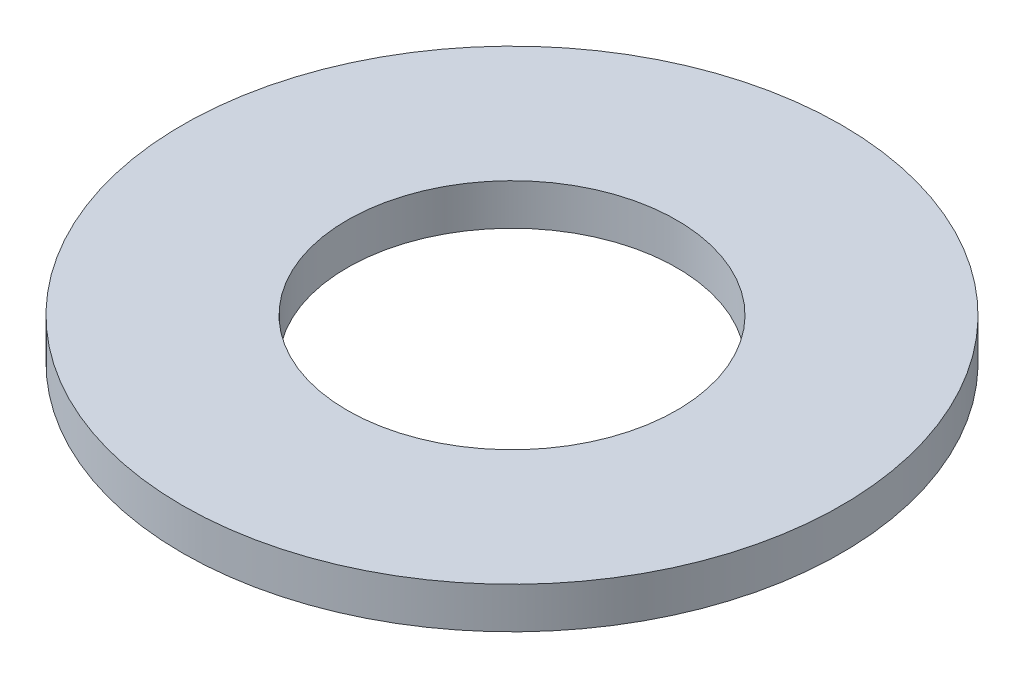
ISO-10303-21;
HEADER;
FILE_DESCRIPTION(('STEP AP214'),'2;1');
FILE_NAME('part.step','',(''),(''),'','','');
FILE_SCHEMA(('AUTOMOTIVE_DESIGN { 1 0 10303 214 1 1 1 1 }'));
ENDSEC;
DATA;
#1=APPLICATION_CONTEXT('core data for automotive mechanical design processes');
#2=APPLICATION_PROTOCOL_DEFINITION('international standard','automotive_design',2000,#1);
#3=PRODUCT_CONTEXT('',#1,'mechanical');
#4=PRODUCT('Part','Part','',(#3));
#5=PRODUCT_RELATED_PRODUCT_CATEGORY('part','',(#4));
#6=PRODUCT_DEFINITION_FORMATION('','',#4);
#7=PRODUCT_DEFINITION_CONTEXT('part definition',#1,'design');
#8=PRODUCT_DEFINITION('design','',#6,#7);
#9=PRODUCT_DEFINITION_SHAPE('','',#8);
#10=(LENGTH_UNIT() NAMED_UNIT(*) SI_UNIT(.MILLI.,.METRE.));
#11=(NAMED_UNIT(*) PLANE_ANGLE_UNIT() SI_UNIT($,.RADIAN.));
#12=(NAMED_UNIT(*) SI_UNIT($,.STERADIAN.) SOLID_ANGLE_UNIT());
#13=UNCERTAINTY_MEASURE_WITH_UNIT(LENGTH_MEASURE(1.E-05),#10,'distance_accuracy_value','');
#14=(GEOMETRIC_REPRESENTATION_CONTEXT(3) GLOBAL_UNCERTAINTY_ASSIGNED_CONTEXT((#13)) GLOBAL_UNIT_ASSIGNED_CONTEXT((#10,
#11,#12)) REPRESENTATION_CONTEXT('',''));
#15=CARTESIAN_POINT('',(0.,0.,0.));
#16=DIRECTION('',(0.,0.,1.));
#17=DIRECTION('',(1.,0.,0.));
#18=AXIS2_PLACEMENT_3D('',#15,#16,#17);
#19=CARTESIAN_POINT('',(0.,1.,0.));
#20=DIRECTION('',(0.,1.,0.));
#21=DIRECTION('',(0.,0.,1.));
#22=AXIS2_PLACEMENT_3D('',#19,#20,#21);
#23=PLANE('',#22);
#24=CARTESIAN_POINT('',(0.,1.,0.));
#25=DIRECTION('',(0.,1.,0.));
#26=DIRECTION('',(0.,0.,1.));
#27=AXIS2_PLACEMENT_3D('',#24,#25,#26);
#28=CIRCLE('',#27,8.);
#29=CARTESIAN_POINT('',(0.,1.,8.));
#30=VERTEX_POINT('',#29);
#31=EDGE_CURVE('E10',#30,#30,#28,.T.);
#32=ORIENTED_EDGE('',*,*,#31,.T.);
#33=EDGE_LOOP('',(#32));
#34=FACE_BOUND('',#33,.T.);
#35=CARTESIAN_POINT('',(0.,1.,0.));
#36=DIRECTION('',(0.,1.,0.));
#37=DIRECTION('',(0.,0.,1.));
#38=AXIS2_PLACEMENT_3D('',#35,#36,#37);
#39=CIRCLE('',#38,4.);
#40=CARTESIAN_POINT('',(0.,1.,4.));
#41=VERTEX_POINT('',#40);
#42=EDGE_CURVE('E40',#41,#41,#39,.T.);
#43=ORIENTED_EDGE('',*,*,#42,.F.);
#44=EDGE_LOOP('',(#43));
#45=FACE_BOUND('',#44,.T.);
#46=ADVANCED_FACE('F29',(#34,#45),#23,.T.);
#47=CARTESIAN_POINT('',(0.,0.,0.));
#48=DIRECTION('',(0.,1.,0.));
#49=DIRECTION('',(0.,0.,1.));
#50=AXIS2_PLACEMENT_3D('',#47,#48,#49);
#51=PLANE('',#50);
#52=CARTESIAN_POINT('',(0.,0.,0.));
#53=DIRECTION('',(0.,1.,0.));
#54=DIRECTION('',(0.,0.,1.));
#55=AXIS2_PLACEMENT_3D('',#52,#53,#54);
#56=CIRCLE('',#55,8.);
#57=CARTESIAN_POINT('',(0.,0.,8.));
#58=VERTEX_POINT('',#57);
#59=EDGE_CURVE('E33',#58,#58,#56,.T.);
#60=ORIENTED_EDGE('',*,*,#59,.F.);
#61=EDGE_LOOP('',(#60));
#62=FACE_BOUND('',#61,.T.);
#63=CARTESIAN_POINT('',(0.,0.,0.));
#64=DIRECTION('',(0.,1.,0.));
#65=DIRECTION('',(0.,0.,1.));
#66=AXIS2_PLACEMENT_3D('',#63,#64,#65);
#67=CIRCLE('',#66,4.);
#68=CARTESIAN_POINT('',(0.,0.,4.));
#69=VERTEX_POINT('',#68);
#70=EDGE_CURVE('E42',#69,#69,#67,.T.);
#71=ORIENTED_EDGE('',*,*,#70,.T.);
#72=EDGE_LOOP('',(#71));
#73=FACE_BOUND('',#72,.T.);
#74=ADVANCED_FACE('F52',(#62,#73),#51,.F.);
#75=CARTESIAN_POINT('',(0.,1.,0.));
#76=DIRECTION('',(0.,-1.,0.));
#77=DIRECTION('',(0.,0.,-1.));
#78=AXIS2_PLACEMENT_3D('',#75,#76,#77);
#79=CYLINDRICAL_SURFACE('',#78,8.);
#80=ORIENTED_EDGE('',*,*,#31,.F.);
#81=EDGE_LOOP('',(#80));
#82=FACE_BOUND('',#81,.T.);
#83=ORIENTED_EDGE('',*,*,#59,.T.);
#84=EDGE_LOOP('',(#83));
#85=FACE_BOUND('',#84,.T.);
#86=ADVANCED_FACE('F31',(#82,#85),#79,.T.);
#87=CARTESIAN_POINT('',(0.,1.,0.));
#88=DIRECTION('',(0.,-1.,0.));
#89=DIRECTION('',(0.,0.,-1.));
#90=AXIS2_PLACEMENT_3D('',#87,#88,#89);
#91=CYLINDRICAL_SURFACE('',#90,4.);
#92=ORIENTED_EDGE('',*,*,#42,.T.);
#93=EDGE_LOOP('',(#92));
#94=FACE_BOUND('',#93,.T.);
#95=ORIENTED_EDGE('',*,*,#70,.F.);
#96=EDGE_LOOP('',(#95));
#97=FACE_BOUND('',#96,.T.);
#98=ADVANCED_FACE('F48',(#94,#97),#91,.F.);
#99=CLOSED_SHELL('',(#46,#74,#86,#98));
#100=MANIFOLD_SOLID_BREP('B2',#99);
#101=ADVANCED_BREP_SHAPE_REPRESENTATION('',(#18,#100),#14);
#102=SHAPE_DEFINITION_REPRESENTATION(#9,#101);
ENDSEC;
END-ISO-10303-21;
